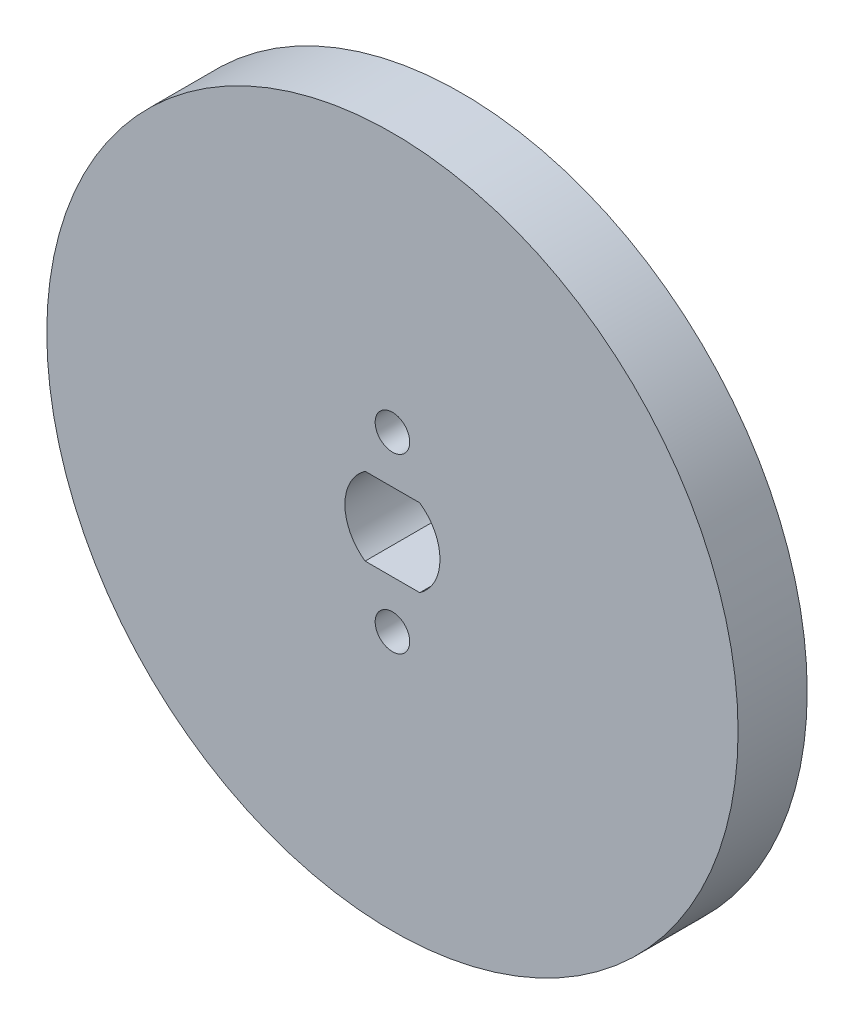
ISO-10303-21;
HEADER;
FILE_DESCRIPTION(('STEP AP214'),'2;1');
FILE_NAME('part.step','',(''),(''),'','','');
FILE_SCHEMA(('AUTOMOTIVE_DESIGN { 1 0 10303 214 1 1 1 1 }'));
ENDSEC;
DATA;
#1=APPLICATION_CONTEXT('core data for automotive mechanical design processes');
#2=APPLICATION_PROTOCOL_DEFINITION('international standard','automotive_design',2000,#1);
#3=PRODUCT_CONTEXT('',#1,'mechanical');
#4=PRODUCT('Part','Part','',(#3));
#5=PRODUCT_RELATED_PRODUCT_CATEGORY('part','',(#4));
#6=PRODUCT_DEFINITION_FORMATION('','',#4);
#7=PRODUCT_DEFINITION_CONTEXT('part definition',#1,'design');
#8=PRODUCT_DEFINITION('design','',#6,#7);
#9=PRODUCT_DEFINITION_SHAPE('','',#8);
#10=(LENGTH_UNIT() NAMED_UNIT(*) SI_UNIT(.MILLI.,.METRE.));
#11=(NAMED_UNIT(*) PLANE_ANGLE_UNIT() SI_UNIT($,.RADIAN.));
#12=(NAMED_UNIT(*) SI_UNIT($,.STERADIAN.) SOLID_ANGLE_UNIT());
#13=UNCERTAINTY_MEASURE_WITH_UNIT(LENGTH_MEASURE(1.E-05),#10,'distance_accuracy_value','');
#14=(GEOMETRIC_REPRESENTATION_CONTEXT(3) GLOBAL_UNCERTAINTY_ASSIGNED_CONTEXT((#13)) GLOBAL_UNIT_ASSIGNED_CONTEXT((#10,
#11,#12)) REPRESENTATION_CONTEXT('',''));
#15=CARTESIAN_POINT('',(0.,0.,0.));
#16=DIRECTION('',(0.,0.,1.));
#17=DIRECTION('',(1.,0.,0.));
#18=AXIS2_PLACEMENT_3D('',#15,#16,#17);
#19=CARTESIAN_POINT('',(0.,0.,4.));
#20=DIRECTION('',(0.,0.,-1.));
#21=DIRECTION('',(-1.,0.,0.));
#22=AXIS2_PLACEMENT_3D('',#19,#20,#21);
#23=CYLINDRICAL_SURFACE('',#22,20.);
#24=CARTESIAN_POINT('',(0.,0.,4.));
#25=DIRECTION('',(0.,0.,1.));
#26=DIRECTION('',(1.,0.,0.));
#27=AXIS2_PLACEMENT_3D('',#24,#25,#26);
#28=CIRCLE('',#27,20.);
#29=CARTESIAN_POINT('',(20.,0.,4.));
#30=VERTEX_POINT('',#29);
#31=EDGE_CURVE('E11',#30,#30,#28,.T.);
#32=ORIENTED_EDGE('',*,*,#31,.F.);
#33=EDGE_LOOP('',(#32));
#34=FACE_BOUND('',#33,.T.);
#35=CARTESIAN_POINT('',(0.,0.,0.));
#36=DIRECTION('',(0.,0.,1.));
#37=DIRECTION('',(1.,0.,0.));
#38=AXIS2_PLACEMENT_3D('',#35,#36,#37);
#39=CIRCLE('',#38,20.);
#40=CARTESIAN_POINT('',(20.,0.,0.));
#41=VERTEX_POINT('',#40);
#42=EDGE_CURVE('E42',#41,#41,#39,.T.);
#43=ORIENTED_EDGE('',*,*,#42,.T.);
#44=EDGE_LOOP('',(#43));
#45=FACE_BOUND('',#44,.T.);
#46=ADVANCED_FACE('F39',(#34,#45),#23,.T.);
#47=CARTESIAN_POINT('',(0.,0.,4.));
#48=DIRECTION('',(0.,0.,1.));
#49=DIRECTION('',(1.,0.,0.));
#50=AXIS2_PLACEMENT_3D('',#47,#48,#49);
#51=PLANE('',#50);
#52=CARTESIAN_POINT('',(0.,5.,4.));
#53=DIRECTION('',(0.,0.,1.));
#54=DIRECTION('',(1.,0.,0.));
#55=AXIS2_PLACEMENT_3D('',#52,#53,#54);
#56=CIRCLE('',#55,1.);
#57=CARTESIAN_POINT('',(1.,5.,4.));
#58=VERTEX_POINT('',#57);
#59=EDGE_CURVE('E108',#58,#58,#56,.T.);
#60=ORIENTED_EDGE('',*,*,#59,.F.);
#61=EDGE_LOOP('',(#60));
#62=FACE_BOUND('',#61,.T.);
#63=CARTESIAN_POINT('',(0.,0.,4.));
#64=DIRECTION('',(0.,0.,1.));
#65=DIRECTION('',(1.,0.,0.));
#66=AXIS2_PLACEMENT_3D('',#63,#64,#65);
#67=CIRCLE('',#66,2.75);
#68=CARTESIAN_POINT('',(-1.58113883008419,2.25,4.));
#69=VERTEX_POINT('',#68);
#70=CARTESIAN_POINT('',(-1.58113883008419,-2.25,4.));
#71=VERTEX_POINT('',#70);
#72=EDGE_CURVE('E54',#69,#71,#67,.T.);
#73=ORIENTED_EDGE('',*,*,#72,.F.);
#74=DIRECTION('',(-1.,0.,0.));
#75=VECTOR('',#74,1.);
#76=CARTESIAN_POINT('',(-1.58113883008419,2.25,4.));
#77=LINE('',#76,#75);
#78=CARTESIAN_POINT('',(1.58113883008419,2.25,4.));
#79=VERTEX_POINT('',#78);
#80=EDGE_CURVE('E101',#79,#69,#77,.T.);
#81=ORIENTED_EDGE('',*,*,#80,.F.);
#82=CARTESIAN_POINT('',(0.,0.,4.));
#83=DIRECTION('',(0.,0.,1.));
#84=DIRECTION('',(1.,0.,0.));
#85=AXIS2_PLACEMENT_3D('',#82,#83,#84);
#86=CIRCLE('',#85,2.75);
#87=CARTESIAN_POINT('',(1.58113883008419,-2.25,4.));
#88=VERTEX_POINT('',#87);
#89=EDGE_CURVE('E105',#88,#79,#86,.T.);
#90=ORIENTED_EDGE('',*,*,#89,.F.);
#91=DIRECTION('',(1.,0.,0.));
#92=VECTOR('',#91,1.);
#93=CARTESIAN_POINT('',(-1.58113883008419,-2.25,4.));
#94=LINE('',#93,#92);
#95=EDGE_CURVE('E117',#71,#88,#94,.T.);
#96=ORIENTED_EDGE('',*,*,#95,.F.);
#97=EDGE_LOOP('',(#73,#81,#90,#96));
#98=FACE_BOUND('',#97,.T.);
#99=CARTESIAN_POINT('',(0.,-5.,4.));
#100=DIRECTION('',(0.,0.,1.));
#101=DIRECTION('',(-1.,0.,0.));
#102=AXIS2_PLACEMENT_3D('',#99,#100,#101);
#103=CIRCLE('',#102,1.);
#104=CARTESIAN_POINT('',(-1.,-5.,4.));
#105=VERTEX_POINT('',#104);
#106=EDGE_CURVE('E135',#105,#105,#103,.T.);
#107=ORIENTED_EDGE('',*,*,#106,.F.);
#108=EDGE_LOOP('',(#107));
#109=FACE_BOUND('',#108,.T.);
#110=ORIENTED_EDGE('',*,*,#31,.T.);
#111=EDGE_LOOP('',(#110));
#112=FACE_BOUND('',#111,.T.);
#113=ADVANCED_FACE('F142',(#62,#98,#109,#112),#51,.T.);
#114=CARTESIAN_POINT('',(0.,0.,0.));
#115=DIRECTION('',(0.,0.,1.));
#116=DIRECTION('',(1.,0.,0.));
#117=AXIS2_PLACEMENT_3D('',#114,#115,#116);
#118=PLANE('',#117);
#119=CARTESIAN_POINT('',(0.,5.,0.));
#120=DIRECTION('',(0.,0.,1.));
#121=DIRECTION('',(1.,0.,0.));
#122=AXIS2_PLACEMENT_3D('',#119,#120,#121);
#123=CIRCLE('',#122,1.);
#124=CARTESIAN_POINT('',(1.,5.,0.));
#125=VERTEX_POINT('',#124);
#126=EDGE_CURVE('E155',#125,#125,#123,.T.);
#127=ORIENTED_EDGE('',*,*,#126,.T.);
#128=EDGE_LOOP('',(#127));
#129=FACE_BOUND('',#128,.T.);
#130=DIRECTION('',(-1.,0.,0.));
#131=VECTOR('',#130,1.);
#132=CARTESIAN_POINT('',(-1.58113883008419,2.25,0.));
#133=LINE('',#132,#131);
#134=CARTESIAN_POINT('',(1.58113883008419,2.25,0.));
#135=VERTEX_POINT('',#134);
#136=CARTESIAN_POINT('',(-1.58113883008419,2.25,0.));
#137=VERTEX_POINT('',#136);
#138=EDGE_CURVE('E89',#135,#137,#133,.T.);
#139=ORIENTED_EDGE('',*,*,#138,.T.);
#140=CARTESIAN_POINT('',(0.,0.,0.));
#141=DIRECTION('',(0.,0.,1.));
#142=DIRECTION('',(1.,0.,0.));
#143=AXIS2_PLACEMENT_3D('',#140,#141,#142);
#144=CIRCLE('',#143,2.75);
#145=CARTESIAN_POINT('',(-1.58113883008419,-2.25,0.));
#146=VERTEX_POINT('',#145);
#147=EDGE_CURVE('E82',#137,#146,#144,.T.);
#148=ORIENTED_EDGE('',*,*,#147,.T.);
#149=DIRECTION('',(1.,0.,0.));
#150=VECTOR('',#149,1.);
#151=CARTESIAN_POINT('',(-1.58113883008419,-2.25,0.));
#152=LINE('',#151,#150);
#153=CARTESIAN_POINT('',(1.58113883008419,-2.25,0.));
#154=VERTEX_POINT('',#153);
#155=EDGE_CURVE('E92',#146,#154,#152,.T.);
#156=ORIENTED_EDGE('',*,*,#155,.T.);
#157=CARTESIAN_POINT('',(0.,0.,0.));
#158=DIRECTION('',(0.,0.,1.));
#159=DIRECTION('',(1.,0.,0.));
#160=AXIS2_PLACEMENT_3D('',#157,#158,#159);
#161=CIRCLE('',#160,2.75);
#162=EDGE_CURVE('E62',#154,#135,#161,.T.);
#163=ORIENTED_EDGE('',*,*,#162,.T.);
#164=EDGE_LOOP('',(#139,#148,#156,#163));
#165=FACE_BOUND('',#164,.T.);
#166=CARTESIAN_POINT('',(0.,-5.,0.));
#167=DIRECTION('',(0.,0.,1.));
#168=DIRECTION('',(-1.,0.,0.));
#169=AXIS2_PLACEMENT_3D('',#166,#167,#168);
#170=CIRCLE('',#169,1.);
#171=CARTESIAN_POINT('',(-1.,-5.,0.));
#172=VERTEX_POINT('',#171);
#173=EDGE_CURVE('E118',#172,#172,#170,.T.);
#174=ORIENTED_EDGE('',*,*,#173,.T.);
#175=EDGE_LOOP('',(#174));
#176=FACE_BOUND('',#175,.T.);
#177=ORIENTED_EDGE('',*,*,#42,.F.);
#178=EDGE_LOOP('',(#177));
#179=FACE_BOUND('',#178,.T.);
#180=ADVANCED_FACE('F97',(#129,#165,#176,#179),#118,.F.);
#181=CARTESIAN_POINT('',(0.,-5.,0.));
#182=DIRECTION('',(0.,0.,1.));
#183=DIRECTION('',(1.,0.,0.));
#184=AXIS2_PLACEMENT_3D('',#181,#182,#183);
#185=CYLINDRICAL_SURFACE('',#184,1.);
#186=ORIENTED_EDGE('',*,*,#173,.F.);
#187=EDGE_LOOP('',(#186));
#188=FACE_BOUND('',#187,.T.);
#189=ORIENTED_EDGE('',*,*,#106,.T.);
#190=EDGE_LOOP('',(#189));
#191=FACE_BOUND('',#190,.T.);
#192=ADVANCED_FACE('F140',(#188,#191),#185,.F.);
#193=CARTESIAN_POINT('',(0.,0.,0.));
#194=DIRECTION('',(0.,0.,1.));
#195=DIRECTION('',(1.,0.,0.));
#196=AXIS2_PLACEMENT_3D('',#193,#194,#195);
#197=CYLINDRICAL_SURFACE('',#196,2.75);
#198=ORIENTED_EDGE('',*,*,#72,.T.);
#199=DIRECTION('',(0.,0.,1.));
#200=VECTOR('',#199,1.);
#201=CARTESIAN_POINT('',(-1.58113883008419,-2.25,0.));
#202=LINE('',#201,#200);
#203=EDGE_CURVE('E78',#146,#71,#202,.T.);
#204=ORIENTED_EDGE('',*,*,#203,.F.);
#205=ORIENTED_EDGE('',*,*,#147,.F.);
#206=DIRECTION('',(0.,0.,1.));
#207=VECTOR('',#206,1.);
#208=CARTESIAN_POINT('',(-1.58113883008419,2.25,0.));
#209=LINE('',#208,#207);
#210=EDGE_CURVE('E124',#137,#69,#209,.T.);
#211=ORIENTED_EDGE('',*,*,#210,.T.);
#212=EDGE_LOOP('',(#198,#204,#205,#211));
#213=FACE_BOUND('',#212,.T.);
#214=ADVANCED_FACE('F80',(#213),#197,.F.);
#215=CARTESIAN_POINT('',(-1.58113883008419,2.25,0.));
#216=DIRECTION('',(0.,1.,0.));
#217=DIRECTION('',(0.,0.,1.));
#218=AXIS2_PLACEMENT_3D('',#215,#216,#217);
#219=PLANE('',#218);
#220=ORIENTED_EDGE('',*,*,#80,.T.);
#221=ORIENTED_EDGE('',*,*,#210,.F.);
#222=ORIENTED_EDGE('',*,*,#138,.F.);
#223=DIRECTION('',(0.,0.,1.));
#224=VECTOR('',#223,1.);
#225=CARTESIAN_POINT('',(1.58113883008419,2.25,0.));
#226=LINE('',#225,#224);
#227=EDGE_CURVE('E127',#135,#79,#226,.T.);
#228=ORIENTED_EDGE('',*,*,#227,.T.);
#229=EDGE_LOOP('',(#220,#221,#222,#228));
#230=FACE_BOUND('',#229,.T.);
#231=ADVANCED_FACE('F170',(#230),#219,.F.);
#232=CARTESIAN_POINT('',(0.,0.,0.));
#233=DIRECTION('',(0.,0.,1.));
#234=DIRECTION('',(1.,0.,0.));
#235=AXIS2_PLACEMENT_3D('',#232,#233,#234);
#236=CYLINDRICAL_SURFACE('',#235,2.75);
#237=ORIENTED_EDGE('',*,*,#89,.T.);
#238=ORIENTED_EDGE('',*,*,#227,.F.);
#239=ORIENTED_EDGE('',*,*,#162,.F.);
#240=DIRECTION('',(0.,0.,1.));
#241=VECTOR('',#240,1.);
#242=CARTESIAN_POINT('',(1.58113883008419,-2.25,0.));
#243=LINE('',#242,#241);
#244=EDGE_CURVE('E88',#154,#88,#243,.T.);
#245=ORIENTED_EDGE('',*,*,#244,.T.);
#246=EDGE_LOOP('',(#237,#238,#239,#245));
#247=FACE_BOUND('',#246,.T.);
#248=ADVANCED_FACE('F168',(#247),#236,.F.);
#249=CARTESIAN_POINT('',(-1.58113883008419,-2.25,0.));
#250=DIRECTION('',(0.,-1.,0.));
#251=DIRECTION('',(0.,0.,-1.));
#252=AXIS2_PLACEMENT_3D('',#249,#250,#251);
#253=PLANE('',#252);
#254=ORIENTED_EDGE('',*,*,#95,.T.);
#255=ORIENTED_EDGE('',*,*,#244,.F.);
#256=ORIENTED_EDGE('',*,*,#155,.F.);
#257=ORIENTED_EDGE('',*,*,#203,.T.);
#258=EDGE_LOOP('',(#254,#255,#256,#257));
#259=FACE_BOUND('',#258,.T.);
#260=ADVANCED_FACE('F93',(#259),#253,.F.);
#261=CARTESIAN_POINT('',(0.,5.,0.));
#262=DIRECTION('',(0.,0.,1.));
#263=DIRECTION('',(1.,0.,0.));
#264=AXIS2_PLACEMENT_3D('',#261,#262,#263);
#265=CYLINDRICAL_SURFACE('',#264,1.);
#266=ORIENTED_EDGE('',*,*,#126,.F.);
#267=EDGE_LOOP('',(#266));
#268=FACE_BOUND('',#267,.T.);
#269=ORIENTED_EDGE('',*,*,#59,.T.);
#270=EDGE_LOOP('',(#269));
#271=FACE_BOUND('',#270,.T.);
#272=ADVANCED_FACE('F164',(#268,#271),#265,.F.);
#273=CLOSED_SHELL('',(#46,#113,#180,#192,#214,#231,#248,#260,#272));
#274=MANIFOLD_SOLID_BREP('B2',#273);
#275=ADVANCED_BREP_SHAPE_REPRESENTATION('',(#18,#274),#14);
#276=SHAPE_DEFINITION_REPRESENTATION(#9,#275);
ENDSEC;
END-ISO-10303-21;
